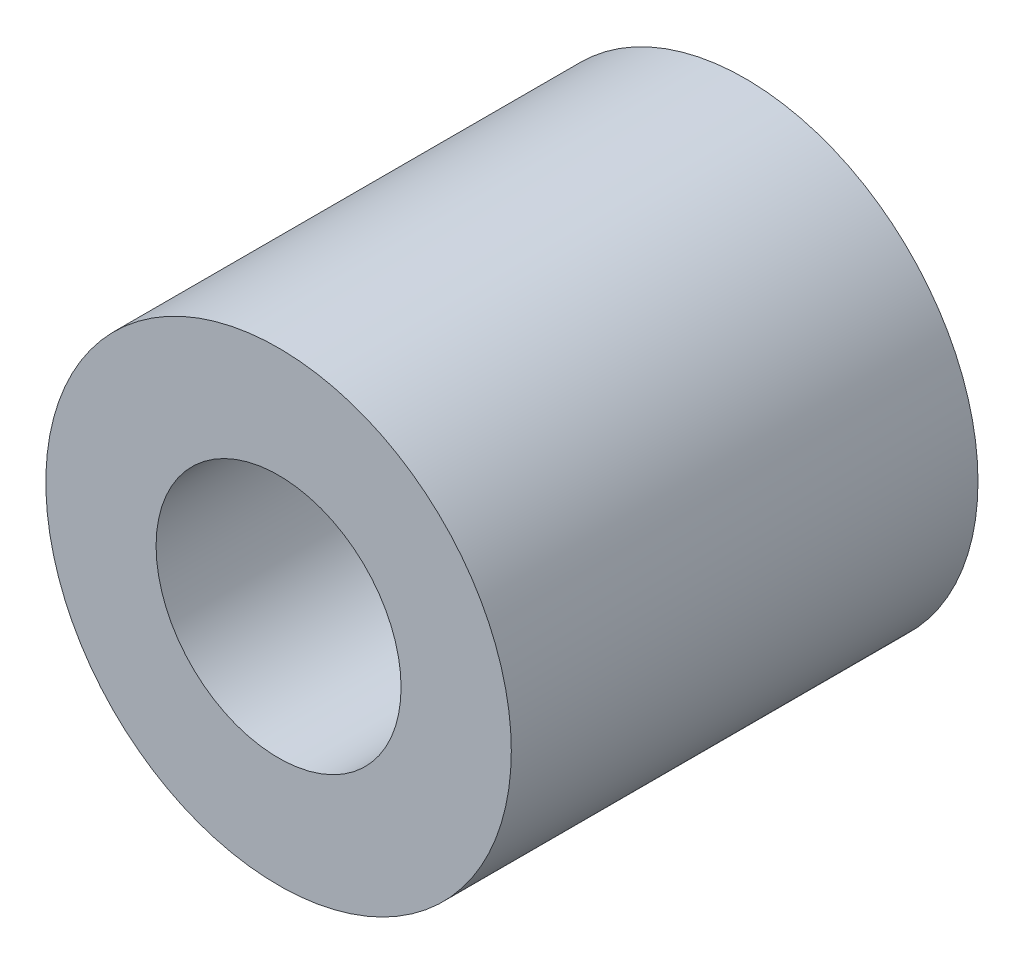
ISO-10303-21;
HEADER;
FILE_DESCRIPTION(('STEP AP214'),'2;1');
FILE_NAME('part.step','',(''),(''),'','','');
FILE_SCHEMA(('AUTOMOTIVE_DESIGN { 1 0 10303 214 1 1 1 1 }'));
ENDSEC;
DATA;
#1=APPLICATION_CONTEXT('core data for automotive mechanical design processes');
#2=APPLICATION_PROTOCOL_DEFINITION('international standard','automotive_design',2000,#1);
#3=PRODUCT_CONTEXT('',#1,'mechanical');
#4=PRODUCT('Part','Part','',(#3));
#5=PRODUCT_RELATED_PRODUCT_CATEGORY('part','',(#4));
#6=PRODUCT_DEFINITION_FORMATION('','',#4);
#7=PRODUCT_DEFINITION_CONTEXT('part definition',#1,'design');
#8=PRODUCT_DEFINITION('design','',#6,#7);
#9=PRODUCT_DEFINITION_SHAPE('','',#8);
#10=(LENGTH_UNIT() NAMED_UNIT(*) SI_UNIT(.MILLI.,.METRE.));
#11=(NAMED_UNIT(*) PLANE_ANGLE_UNIT() SI_UNIT($,.RADIAN.));
#12=(NAMED_UNIT(*) SI_UNIT($,.STERADIAN.) SOLID_ANGLE_UNIT());
#13=UNCERTAINTY_MEASURE_WITH_UNIT(LENGTH_MEASURE(1.E-05),#10,'distance_accuracy_value','');
#14=(GEOMETRIC_REPRESENTATION_CONTEXT(3) GLOBAL_UNCERTAINTY_ASSIGNED_CONTEXT((#13)) GLOBAL_UNIT_ASSIGNED_CONTEXT((#10,
#11,#12)) REPRESENTATION_CONTEXT('',''));
#15=CARTESIAN_POINT('',(0.,0.,0.));
#16=DIRECTION('',(0.,0.,1.));
#17=DIRECTION('',(1.,0.,0.));
#18=AXIS2_PLACEMENT_3D('',#15,#16,#17);
#19=CARTESIAN_POINT('',(0.,0.,-4.7625));
#20=DIRECTION('',(0.,0.,1.));
#21=DIRECTION('',(1.,0.,0.));
#22=AXIS2_PLACEMENT_3D('',#19,#20,#21);
#23=CYLINDRICAL_SURFACE('',#22,2.5);
#24=CARTESIAN_POINT('',(0.,0.,4.7625));
#25=DIRECTION('',(0.,0.,1.));
#26=DIRECTION('',(1.,0.,0.));
#27=AXIS2_PLACEMENT_3D('',#24,#25,#26);
#28=CIRCLE('',#27,2.5);
#29=CARTESIAN_POINT('',(2.5,0.,4.7625));
#30=VERTEX_POINT('',#29);
#31=EDGE_CURVE('E16',#30,#30,#28,.F.);
#32=ORIENTED_EDGE('',*,*,#31,.F.);
#33=EDGE_LOOP('',(#32));
#34=FACE_BOUND('',#33,.T.);
#35=CARTESIAN_POINT('',(0.,0.,-4.7625));
#36=DIRECTION('',(0.,0.,1.));
#37=DIRECTION('',(1.,0.,0.));
#38=AXIS2_PLACEMENT_3D('',#35,#36,#37);
#39=CIRCLE('',#38,2.5);
#40=CARTESIAN_POINT('',(2.5,0.,-4.7625));
#41=VERTEX_POINT('',#40);
#42=EDGE_CURVE('E25',#41,#41,#39,.F.);
#43=ORIENTED_EDGE('',*,*,#42,.T.);
#44=EDGE_LOOP('',(#43));
#45=FACE_BOUND('',#44,.T.);
#46=ADVANCED_FACE('F13',(#34,#45),#23,.F.);
#47=CARTESIAN_POINT('',(0.,0.,4.7625));
#48=DIRECTION('',(0.,0.,1.));
#49=DIRECTION('',(1.,0.,0.));
#50=AXIS2_PLACEMENT_3D('',#47,#48,#49);
#51=PLANE('',#50);
#52=ORIENTED_EDGE('',*,*,#31,.T.);
#53=EDGE_LOOP('',(#52));
#54=FACE_BOUND('',#53,.T.);
#55=CARTESIAN_POINT('',(0.,0.,4.7625));
#56=DIRECTION('',(0.,0.,1.));
#57=DIRECTION('',(1.,0.,0.));
#58=AXIS2_PLACEMENT_3D('',#55,#56,#57);
#59=CIRCLE('',#58,4.75);
#60=CARTESIAN_POINT('',(4.75,0.,4.7625));
#61=VERTEX_POINT('',#60);
#62=EDGE_CURVE('E20',#61,#61,#59,.F.);
#63=ORIENTED_EDGE('',*,*,#62,.F.);
#64=EDGE_LOOP('',(#63));
#65=FACE_BOUND('',#64,.T.);
#66=ADVANCED_FACE('F33',(#54,#65),#51,.T.);
#67=CARTESIAN_POINT('',(0.,0.,-4.7625));
#68=DIRECTION('',(0.,0.,1.));
#69=DIRECTION('',(1.,0.,0.));
#70=AXIS2_PLACEMENT_3D('',#67,#68,#69);
#71=PLANE('',#70);
#72=ORIENTED_EDGE('',*,*,#42,.F.);
#73=EDGE_LOOP('',(#72));
#74=FACE_BOUND('',#73,.T.);
#75=CARTESIAN_POINT('',(0.,0.,-4.7625));
#76=DIRECTION('',(0.,0.,1.));
#77=DIRECTION('',(1.,0.,0.));
#78=AXIS2_PLACEMENT_3D('',#75,#76,#77);
#79=CIRCLE('',#78,4.75);
#80=CARTESIAN_POINT('',(4.75,0.,-4.7625));
#81=VERTEX_POINT('',#80);
#82=EDGE_CURVE('E9',#81,#81,#79,.T.);
#83=ORIENTED_EDGE('',*,*,#82,.F.);
#84=EDGE_LOOP('',(#83));
#85=FACE_BOUND('',#84,.T.);
#86=ADVANCED_FACE('F41',(#74,#85),#71,.F.);
#87=CARTESIAN_POINT('',(0.,0.,-4.7625));
#88=DIRECTION('',(0.,0.,1.));
#89=DIRECTION('',(1.,0.,0.));
#90=AXIS2_PLACEMENT_3D('',#87,#88,#89);
#91=CYLINDRICAL_SURFACE('',#90,4.75);
#92=ORIENTED_EDGE('',*,*,#62,.T.);
#93=EDGE_LOOP('',(#92));
#94=FACE_BOUND('',#93,.T.);
#95=ORIENTED_EDGE('',*,*,#82,.T.);
#96=EDGE_LOOP('',(#95));
#97=FACE_BOUND('',#96,.T.);
#98=ADVANCED_FACE('F42',(#94,#97),#91,.T.);
#99=CLOSED_SHELL('',(#46,#66,#86,#98));
#100=MANIFOLD_SOLID_BREP('B1',#99);
#101=ADVANCED_BREP_SHAPE_REPRESENTATION('',(#18,#100),#14);
#102=SHAPE_DEFINITION_REPRESENTATION(#9,#101);
ENDSEC;
END-ISO-10303-21;
